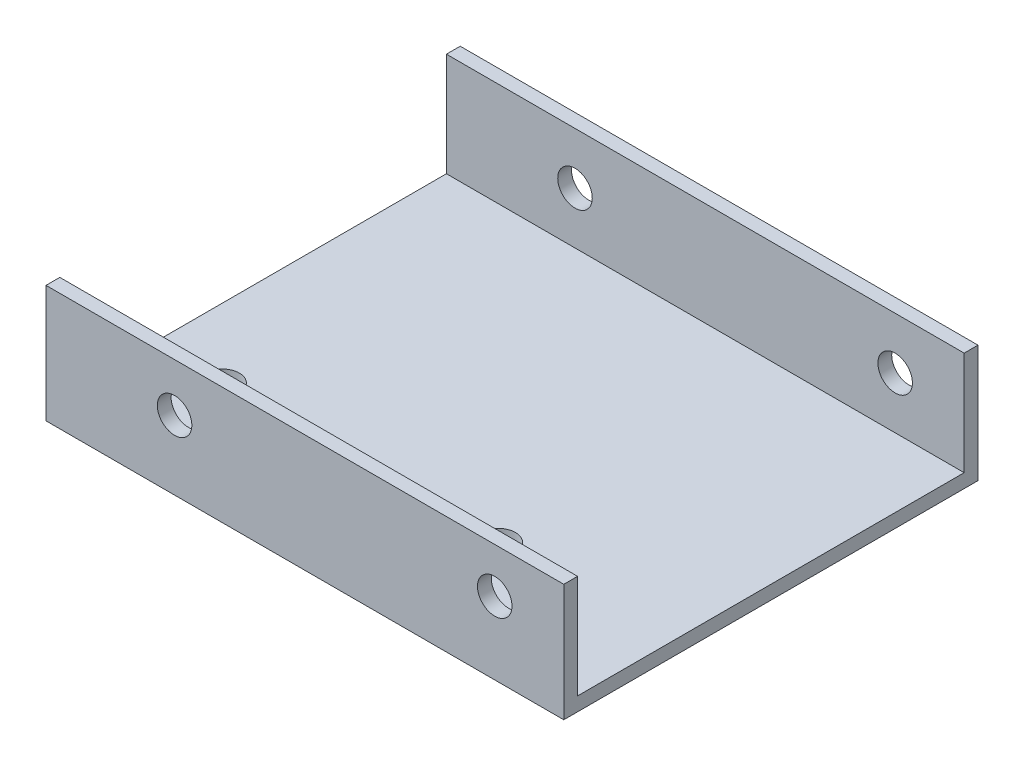
ISO-10303-21;
HEADER;
FILE_DESCRIPTION(('STEP AP214'),'2;1');
FILE_NAME('part.step','',(''),(''),'','','');
FILE_SCHEMA(('AUTOMOTIVE_DESIGN { 1 0 10303 214 1 1 1 1 }'));
ENDSEC;
DATA;
#1=APPLICATION_CONTEXT('core data for automotive mechanical design processes');
#2=APPLICATION_PROTOCOL_DEFINITION('international standard','automotive_design',2000,#1);
#3=PRODUCT_CONTEXT('',#1,'mechanical');
#4=PRODUCT('Part','Part','',(#3));
#5=PRODUCT_RELATED_PRODUCT_CATEGORY('part','',(#4));
#6=PRODUCT_DEFINITION_FORMATION('','',#4);
#7=PRODUCT_DEFINITION_CONTEXT('part definition',#1,'design');
#8=PRODUCT_DEFINITION('design','',#6,#7);
#9=PRODUCT_DEFINITION_SHAPE('','',#8);
#10=(LENGTH_UNIT() NAMED_UNIT(*) SI_UNIT(.MILLI.,.METRE.));
#11=(NAMED_UNIT(*) PLANE_ANGLE_UNIT() SI_UNIT($,.RADIAN.));
#12=(NAMED_UNIT(*) SI_UNIT($,.STERADIAN.) SOLID_ANGLE_UNIT());
#13=UNCERTAINTY_MEASURE_WITH_UNIT(LENGTH_MEASURE(1.E-05),#10,'distance_accuracy_value','');
#14=(GEOMETRIC_REPRESENTATION_CONTEXT(3) GLOBAL_UNCERTAINTY_ASSIGNED_CONTEXT((#13)) GLOBAL_UNIT_ASSIGNED_CONTEXT((#10,
#11,#12)) REPRESENTATION_CONTEXT('',''));
#15=CARTESIAN_POINT('',(0.,0.,0.));
#16=DIRECTION('',(0.,0.,1.));
#17=DIRECTION('',(1.,0.,0.));
#18=AXIS2_PLACEMENT_3D('',#15,#16,#17);
#19=CARTESIAN_POINT('',(-37.5,2.,28.));
#20=DIRECTION('',(1.,0.,0.));
#21=DIRECTION('',(0.,0.,-1.));
#22=AXIS2_PLACEMENT_3D('',#19,#20,#21);
#23=PLANE('',#22);
#24=DIRECTION('',(0.,0.,1.));
#25=VECTOR('',#24,1.);
#26=CARTESIAN_POINT('',(-37.5,0.,28.));
#27=LINE('',#26,#25);
#28=CARTESIAN_POINT('',(-37.5,0.,-30.));
#29=VERTEX_POINT('',#28);
#30=CARTESIAN_POINT('',(-37.5,0.,30.));
#31=VERTEX_POINT('',#30);
#32=EDGE_CURVE('E178',#29,#31,#27,.T.);
#33=ORIENTED_EDGE('',*,*,#32,.T.);
#34=DIRECTION('',(0.,-1.,0.));
#35=VECTOR('',#34,1.);
#36=CARTESIAN_POINT('',(-37.5,0.,30.));
#37=LINE('',#36,#35);
#38=CARTESIAN_POINT('',(-37.5,17.,30.));
#39=VERTEX_POINT('',#38);
#40=EDGE_CURVE('E148',#39,#31,#37,.T.);
#41=ORIENTED_EDGE('',*,*,#40,.F.);
#42=DIRECTION('',(0.,0.,-1.));
#43=VECTOR('',#42,1.);
#44=CARTESIAN_POINT('',(-37.5,17.,30.));
#45=LINE('',#44,#43);
#46=CARTESIAN_POINT('',(-37.5,17.,28.));
#47=VERTEX_POINT('',#46);
#48=EDGE_CURVE('E163',#39,#47,#45,.T.);
#49=ORIENTED_EDGE('',*,*,#48,.T.);
#50=DIRECTION('',(0.,-1.,0.));
#51=VECTOR('',#50,1.);
#52=CARTESIAN_POINT('',(-37.5,0.,28.));
#53=LINE('',#52,#51);
#54=CARTESIAN_POINT('',(-37.5,2.,28.));
#55=VERTEX_POINT('',#54);
#56=EDGE_CURVE('E113',#47,#55,#53,.T.);
#57=ORIENTED_EDGE('',*,*,#56,.T.);
#58=DIRECTION('',(0.,0.,1.));
#59=VECTOR('',#58,1.);
#60=CARTESIAN_POINT('',(-37.5,2.,28.));
#61=LINE('',#60,#59);
#62=CARTESIAN_POINT('',(-37.5,2.,-28.));
#63=VERTEX_POINT('',#62);
#64=EDGE_CURVE('E179',#63,#55,#61,.T.);
#65=ORIENTED_EDGE('',*,*,#64,.F.);
#66=DIRECTION('',(0.,-1.,0.));
#67=VECTOR('',#66,1.);
#68=CARTESIAN_POINT('',(-37.5,0.,-28.));
#69=LINE('',#68,#67);
#70=CARTESIAN_POINT('',(-37.5,17.,-28.));
#71=VERTEX_POINT('',#70);
#72=EDGE_CURVE('E55',#71,#63,#69,.T.);
#73=ORIENTED_EDGE('',*,*,#72,.F.);
#74=DIRECTION('',(0.,0.,1.));
#75=VECTOR('',#74,1.);
#76=CARTESIAN_POINT('',(-37.5,17.,-30.));
#77=LINE('',#76,#75);
#78=CARTESIAN_POINT('',(-37.5,17.,-30.));
#79=VERTEX_POINT('',#78);
#80=EDGE_CURVE('E104',#79,#71,#77,.T.);
#81=ORIENTED_EDGE('',*,*,#80,.F.);
#82=DIRECTION('',(0.,-1.,0.));
#83=VECTOR('',#82,1.);
#84=CARTESIAN_POINT('',(-37.5,0.,-30.));
#85=LINE('',#84,#83);
#86=EDGE_CURVE('E106',#79,#29,#85,.T.);
#87=ORIENTED_EDGE('',*,*,#86,.T.);
#88=EDGE_LOOP('',(#33,#41,#49,#57,#65,#73,#81,#87));
#89=FACE_BOUND('',#88,.T.);
#90=ADVANCED_FACE('F38',(#89),#23,.F.);
#91=CARTESIAN_POINT('',(37.5,2.,28.));
#92=DIRECTION('',(-1.,0.,0.));
#93=DIRECTION('',(0.,0.,1.));
#94=AXIS2_PLACEMENT_3D('',#91,#92,#93);
#95=PLANE('',#94);
#96=DIRECTION('',(0.,0.,-1.));
#97=VECTOR('',#96,1.);
#98=CARTESIAN_POINT('',(37.5,0.,28.));
#99=LINE('',#98,#97);
#100=CARTESIAN_POINT('',(37.5,0.,30.));
#101=VERTEX_POINT('',#100);
#102=CARTESIAN_POINT('',(37.5,0.,-30.));
#103=VERTEX_POINT('',#102);
#104=EDGE_CURVE('E41',#101,#103,#99,.T.);
#105=ORIENTED_EDGE('',*,*,#104,.T.);
#106=DIRECTION('',(0.,1.,0.));
#107=VECTOR('',#106,1.);
#108=CARTESIAN_POINT('',(37.5,0.,-30.));
#109=LINE('',#108,#107);
#110=CARTESIAN_POINT('',(37.5,17.,-30.));
#111=VERTEX_POINT('',#110);
#112=EDGE_CURVE('E130',#103,#111,#109,.T.);
#113=ORIENTED_EDGE('',*,*,#112,.T.);
#114=DIRECTION('',(0.,0.,1.));
#115=VECTOR('',#114,1.);
#116=CARTESIAN_POINT('',(37.5,17.,-30.));
#117=LINE('',#116,#115);
#118=CARTESIAN_POINT('',(37.5,17.,-28.));
#119=VERTEX_POINT('',#118);
#120=EDGE_CURVE('E114',#111,#119,#117,.T.);
#121=ORIENTED_EDGE('',*,*,#120,.T.);
#122=DIRECTION('',(0.,1.,0.));
#123=VECTOR('',#122,1.);
#124=CARTESIAN_POINT('',(37.5,0.,-28.));
#125=LINE('',#124,#123);
#126=CARTESIAN_POINT('',(37.5,2.,-28.));
#127=VERTEX_POINT('',#126);
#128=EDGE_CURVE('E125',#127,#119,#125,.T.);
#129=ORIENTED_EDGE('',*,*,#128,.F.);
#130=DIRECTION('',(0.,0.,-1.));
#131=VECTOR('',#130,1.);
#132=CARTESIAN_POINT('',(37.5,2.,28.));
#133=LINE('',#132,#131);
#134=CARTESIAN_POINT('',(37.5,2.,28.));
#135=VERTEX_POINT('',#134);
#136=EDGE_CURVE('E47',#135,#127,#133,.T.);
#137=ORIENTED_EDGE('',*,*,#136,.F.);
#138=DIRECTION('',(0.,1.,0.));
#139=VECTOR('',#138,1.);
#140=CARTESIAN_POINT('',(37.5,0.,28.));
#141=LINE('',#140,#139);
#142=CARTESIAN_POINT('',(37.5,17.,28.));
#143=VERTEX_POINT('',#142);
#144=EDGE_CURVE('E62',#135,#143,#141,.T.);
#145=ORIENTED_EDGE('',*,*,#144,.T.);
#146=DIRECTION('',(0.,0.,-1.));
#147=VECTOR('',#146,1.);
#148=CARTESIAN_POINT('',(37.5,17.,30.));
#149=LINE('',#148,#147);
#150=CARTESIAN_POINT('',(37.5,17.,30.));
#151=VERTEX_POINT('',#150);
#152=EDGE_CURVE('E174',#151,#143,#149,.T.);
#153=ORIENTED_EDGE('',*,*,#152,.F.);
#154=DIRECTION('',(0.,1.,0.));
#155=VECTOR('',#154,1.);
#156=CARTESIAN_POINT('',(37.5,0.,30.));
#157=LINE('',#156,#155);
#158=EDGE_CURVE('E157',#101,#151,#157,.T.);
#159=ORIENTED_EDGE('',*,*,#158,.F.);
#160=EDGE_LOOP('',(#105,#113,#121,#129,#137,#145,#153,#159));
#161=FACE_BOUND('',#160,.T.);
#162=ADVANCED_FACE('F194',(#161),#95,.F.);
#163=CARTESIAN_POINT('',(0.,2.,0.));
#164=DIRECTION('',(0.,1.,0.));
#165=DIRECTION('',(0.,0.,1.));
#166=AXIS2_PLACEMENT_3D('',#163,#164,#165);
#167=PLANE('',#166);
#168=CARTESIAN_POINT('',(12.5,2.,14.4999999999972));
#169=DIRECTION('',(0.,-1.,0.));
#170=DIRECTION('',(0.,0.,-1.));
#171=AXIS2_PLACEMENT_3D('',#168,#169,#170);
#172=CIRCLE('',#171,2.5000000000005);
#173=CARTESIAN_POINT('',(12.5,2.,11.9999999999967));
#174=VERTEX_POINT('',#173);
#175=EDGE_CURVE('E266',#174,#174,#172,.T.);
#176=ORIENTED_EDGE('',*,*,#175,.T.);
#177=EDGE_LOOP('',(#176));
#178=FACE_BOUND('',#177,.T.);
#179=CARTESIAN_POINT('',(-27.4999999999997,2.,14.4999999999973));
#180=DIRECTION('',(0.,-1.,0.));
#181=DIRECTION('',(0.,0.,-1.));
#182=AXIS2_PLACEMENT_3D('',#179,#180,#181);
#183=CIRCLE('',#182,2.50000000000049);
#184=CARTESIAN_POINT('',(-27.4999999999997,2.,11.9999999999968));
#185=VERTEX_POINT('',#184);
#186=EDGE_CURVE('E271',#185,#185,#183,.T.);
#187=ORIENTED_EDGE('',*,*,#186,.T.);
#188=EDGE_LOOP('',(#187));
#189=FACE_BOUND('',#188,.T.);
#190=ORIENTED_EDGE('',*,*,#64,.T.);
#191=DIRECTION('',(1.,0.,0.));
#192=VECTOR('',#191,1.);
#193=CARTESIAN_POINT('',(37.5,2.,28.));
#194=LINE('',#193,#192);
#195=EDGE_CURVE('E183',#55,#135,#194,.T.);
#196=ORIENTED_EDGE('',*,*,#195,.T.);
#197=ORIENTED_EDGE('',*,*,#136,.T.);
#198=DIRECTION('',(-1.,0.,0.));
#199=VECTOR('',#198,1.);
#200=CARTESIAN_POINT('',(37.5,2.,-28.));
#201=LINE('',#200,#199);
#202=EDGE_CURVE('E11',#127,#63,#201,.T.);
#203=ORIENTED_EDGE('',*,*,#202,.T.);
#204=EDGE_LOOP('',(#190,#196,#197,#203));
#205=FACE_BOUND('',#204,.T.);
#206=ADVANCED_FACE('F207',(#178,#189,#205),#167,.T.);
#207=CARTESIAN_POINT('',(0.,0.,0.));
#208=DIRECTION('',(0.,1.,0.));
#209=DIRECTION('',(0.,0.,1.));
#210=AXIS2_PLACEMENT_3D('',#207,#208,#209);
#211=PLANE('',#210);
#212=CARTESIAN_POINT('',(12.5,0.,14.4999999999972));
#213=DIRECTION('',(0.,-1.,0.));
#214=DIRECTION('',(0.,0.,-1.));
#215=AXIS2_PLACEMENT_3D('',#212,#213,#214);
#216=CIRCLE('',#215,2.5000000000005);
#217=CARTESIAN_POINT('',(12.5,0.,11.9999999999967));
#218=VERTEX_POINT('',#217);
#219=EDGE_CURVE('E276',#218,#218,#216,.T.);
#220=ORIENTED_EDGE('',*,*,#219,.F.);
#221=EDGE_LOOP('',(#220));
#222=FACE_BOUND('',#221,.T.);
#223=CARTESIAN_POINT('',(-27.4999999999997,0.,14.4999999999973));
#224=DIRECTION('',(0.,-1.,0.));
#225=DIRECTION('',(0.,0.,-1.));
#226=AXIS2_PLACEMENT_3D('',#223,#224,#225);
#227=CIRCLE('',#226,2.50000000000049);
#228=CARTESIAN_POINT('',(-27.4999999999997,0.,11.9999999999968));
#229=VERTEX_POINT('',#228);
#230=EDGE_CURVE('E267',#229,#229,#227,.T.);
#231=ORIENTED_EDGE('',*,*,#230,.F.);
#232=EDGE_LOOP('',(#231));
#233=FACE_BOUND('',#232,.T.);
#234=ORIENTED_EDGE('',*,*,#32,.F.);
#235=DIRECTION('',(1.,0.,0.));
#236=VECTOR('',#235,1.);
#237=CARTESIAN_POINT('',(-37.5,0.,-30.));
#238=LINE('',#237,#236);
#239=EDGE_CURVE('E123',#29,#103,#238,.T.);
#240=ORIENTED_EDGE('',*,*,#239,.T.);
#241=ORIENTED_EDGE('',*,*,#104,.F.);
#242=DIRECTION('',(1.,0.,0.));
#243=VECTOR('',#242,1.);
#244=CARTESIAN_POINT('',(-37.5,0.,30.));
#245=LINE('',#244,#243);
#246=EDGE_CURVE('E152',#31,#101,#245,.T.);
#247=ORIENTED_EDGE('',*,*,#246,.F.);
#248=EDGE_LOOP('',(#234,#240,#241,#247));
#249=FACE_BOUND('',#248,.T.);
#250=ADVANCED_FACE('F197',(#222,#233,#249),#211,.F.);
#251=CARTESIAN_POINT('',(0.,0.,28.));
#252=DIRECTION('',(0.,0.,-1.));
#253=DIRECTION('',(-1.,0.,0.));
#254=AXIS2_PLACEMENT_3D('',#251,#252,#253);
#255=PLANE('',#254);
#256=CARTESIAN_POINT('',(27.5,10.5,28.));
#257=DIRECTION('',(0.,0.,-1.));
#258=DIRECTION('',(-1.,0.,0.));
#259=AXIS2_PLACEMENT_3D('',#256,#257,#258);
#260=CIRCLE('',#259,2.5);
#261=CARTESIAN_POINT('',(25.,10.5,28.));
#262=VERTEX_POINT('',#261);
#263=EDGE_CURVE('E250',#262,#262,#260,.F.);
#264=ORIENTED_EDGE('',*,*,#263,.T.);
#265=EDGE_LOOP('',(#264));
#266=FACE_BOUND('',#265,.T.);
#267=CARTESIAN_POINT('',(-18.875,10.,28.));
#268=DIRECTION('',(0.,0.,-1.));
#269=DIRECTION('',(-1.,0.,0.));
#270=AXIS2_PLACEMENT_3D('',#267,#268,#269);
#271=CIRCLE('',#270,2.49999999999999);
#272=CARTESIAN_POINT('',(-21.375,10.,28.));
#273=VERTEX_POINT('',#272);
#274=EDGE_CURVE('E253',#273,#273,#271,.F.);
#275=ORIENTED_EDGE('',*,*,#274,.T.);
#276=EDGE_LOOP('',(#275));
#277=FACE_BOUND('',#276,.T.);
#278=ORIENTED_EDGE('',*,*,#195,.F.);
#279=ORIENTED_EDGE('',*,*,#56,.F.);
#280=DIRECTION('',(-1.,0.,0.));
#281=VECTOR('',#280,1.);
#282=CARTESIAN_POINT('',(-37.5,17.,28.));
#283=LINE('',#282,#281);
#284=EDGE_CURVE('E153',#143,#47,#283,.T.);
#285=ORIENTED_EDGE('',*,*,#284,.F.);
#286=ORIENTED_EDGE('',*,*,#144,.F.);
#287=EDGE_LOOP('',(#278,#279,#285,#286));
#288=FACE_BOUND('',#287,.T.);
#289=ADVANCED_FACE('F204',(#266,#277,#288),#255,.T.);
#290=CARTESIAN_POINT('',(-37.5,17.,30.));
#291=DIRECTION('',(0.,-1.,0.));
#292=DIRECTION('',(0.,0.,-1.));
#293=AXIS2_PLACEMENT_3D('',#290,#291,#292);
#294=PLANE('',#293);
#295=ORIENTED_EDGE('',*,*,#284,.T.);
#296=ORIENTED_EDGE('',*,*,#48,.F.);
#297=DIRECTION('',(-1.,0.,0.));
#298=VECTOR('',#297,1.);
#299=CARTESIAN_POINT('',(-37.5,17.,30.));
#300=LINE('',#299,#298);
#301=EDGE_CURVE('E160',#151,#39,#300,.T.);
#302=ORIENTED_EDGE('',*,*,#301,.F.);
#303=ORIENTED_EDGE('',*,*,#152,.T.);
#304=EDGE_LOOP('',(#295,#296,#302,#303));
#305=FACE_BOUND('',#304,.T.);
#306=ADVANCED_FACE('F220',(#305),#294,.F.);
#307=CARTESIAN_POINT('',(0.,0.,30.));
#308=DIRECTION('',(0.,0.,-1.));
#309=DIRECTION('',(-1.,0.,0.));
#310=AXIS2_PLACEMENT_3D('',#307,#308,#309);
#311=PLANE('',#310);
#312=CARTESIAN_POINT('',(27.5,10.5,30.));
#313=DIRECTION('',(0.,0.,1.));
#314=DIRECTION('',(1.,0.,0.));
#315=AXIS2_PLACEMENT_3D('',#312,#313,#314);
#316=CIRCLE('',#315,2.5);
#317=CARTESIAN_POINT('',(30.,10.5,30.));
#318=VERTEX_POINT('',#317);
#319=EDGE_CURVE('E256',#318,#318,#316,.T.);
#320=ORIENTED_EDGE('',*,*,#319,.F.);
#321=EDGE_LOOP('',(#320));
#322=FACE_BOUND('',#321,.T.);
#323=CARTESIAN_POINT('',(-18.875,10.,30.));
#324=DIRECTION('',(0.,0.,-1.));
#325=DIRECTION('',(-1.,0.,0.));
#326=AXIS2_PLACEMENT_3D('',#323,#324,#325);
#327=CIRCLE('',#326,2.49999999999999);
#328=CARTESIAN_POINT('',(-21.375,10.,30.));
#329=VERTEX_POINT('',#328);
#330=EDGE_CURVE('E141',#329,#329,#327,.F.);
#331=ORIENTED_EDGE('',*,*,#330,.F.);
#332=EDGE_LOOP('',(#331));
#333=FACE_BOUND('',#332,.T.);
#334=ORIENTED_EDGE('',*,*,#40,.T.);
#335=ORIENTED_EDGE('',*,*,#246,.T.);
#336=ORIENTED_EDGE('',*,*,#158,.T.);
#337=ORIENTED_EDGE('',*,*,#301,.T.);
#338=EDGE_LOOP('',(#334,#335,#336,#337));
#339=FACE_BOUND('',#338,.T.);
#340=ADVANCED_FACE('F199',(#322,#333,#339),#311,.F.);
#341=CARTESIAN_POINT('',(0.,0.,-28.));
#342=DIRECTION('',(0.,0.,1.));
#343=DIRECTION('',(-1.,0.,0.));
#344=AXIS2_PLACEMENT_3D('',#341,#342,#343);
#345=PLANE('',#344);
#346=CARTESIAN_POINT('',(-18.875,9.5,-28.));
#347=DIRECTION('',(0.,0.,1.));
#348=DIRECTION('',(1.,0.,0.));
#349=AXIS2_PLACEMENT_3D('',#346,#347,#348);
#350=CIRCLE('',#349,2.5);
#351=CARTESIAN_POINT('',(-16.375,9.5,-28.));
#352=VERTEX_POINT('',#351);
#353=EDGE_CURVE('E294',#352,#352,#350,.F.);
#354=ORIENTED_EDGE('',*,*,#353,.T.);
#355=EDGE_LOOP('',(#354));
#356=FACE_BOUND('',#355,.T.);
#357=CARTESIAN_POINT('',(27.5,9.5,-28.));
#358=DIRECTION('',(0.,0.,1.));
#359=DIRECTION('',(1.,0.,0.));
#360=AXIS2_PLACEMENT_3D('',#357,#358,#359);
#361=CIRCLE('',#360,2.5);
#362=CARTESIAN_POINT('',(30.,9.5,-28.));
#363=VERTEX_POINT('',#362);
#364=EDGE_CURVE('E286',#363,#363,#361,.F.);
#365=ORIENTED_EDGE('',*,*,#364,.T.);
#366=EDGE_LOOP('',(#365));
#367=FACE_BOUND('',#366,.T.);
#368=ORIENTED_EDGE('',*,*,#202,.F.);
#369=ORIENTED_EDGE('',*,*,#128,.T.);
#370=DIRECTION('',(-1.,0.,0.));
#371=VECTOR('',#370,1.);
#372=CARTESIAN_POINT('',(-37.5,17.,-28.));
#373=LINE('',#372,#371);
#374=EDGE_CURVE('E140',#119,#71,#373,.T.);
#375=ORIENTED_EDGE('',*,*,#374,.T.);
#376=ORIENTED_EDGE('',*,*,#72,.T.);
#377=EDGE_LOOP('',(#368,#369,#375,#376));
#378=FACE_BOUND('',#377,.T.);
#379=ADVANCED_FACE('F209',(#356,#367,#378),#345,.T.);
#380=CARTESIAN_POINT('',(-37.5,17.,-30.));
#381=DIRECTION('',(0.,1.,0.));
#382=DIRECTION('',(0.,0.,1.));
#383=AXIS2_PLACEMENT_3D('',#380,#381,#382);
#384=PLANE('',#383);
#385=ORIENTED_EDGE('',*,*,#374,.F.);
#386=ORIENTED_EDGE('',*,*,#120,.F.);
#387=DIRECTION('',(-1.,0.,0.));
#388=VECTOR('',#387,1.);
#389=CARTESIAN_POINT('',(-37.5,17.,-30.));
#390=LINE('',#389,#388);
#391=EDGE_CURVE('E120',#111,#79,#390,.T.);
#392=ORIENTED_EDGE('',*,*,#391,.T.);
#393=ORIENTED_EDGE('',*,*,#80,.T.);
#394=EDGE_LOOP('',(#385,#386,#392,#393));
#395=FACE_BOUND('',#394,.T.);
#396=ADVANCED_FACE('F127',(#395),#384,.T.);
#397=CARTESIAN_POINT('',(0.,0.,-30.));
#398=DIRECTION('',(0.,0.,1.));
#399=DIRECTION('',(-1.,0.,0.));
#400=AXIS2_PLACEMENT_3D('',#397,#398,#399);
#401=PLANE('',#400);
#402=CARTESIAN_POINT('',(-18.875,9.5,-30.));
#403=DIRECTION('',(0.,0.,-1.));
#404=DIRECTION('',(-1.,0.,0.));
#405=AXIS2_PLACEMENT_3D('',#402,#403,#404);
#406=CIRCLE('',#405,2.5);
#407=CARTESIAN_POINT('',(-21.375,9.5,-30.));
#408=VERTEX_POINT('',#407);
#409=EDGE_CURVE('E290',#408,#408,#406,.T.);
#410=ORIENTED_EDGE('',*,*,#409,.F.);
#411=EDGE_LOOP('',(#410));
#412=FACE_BOUND('',#411,.T.);
#413=CARTESIAN_POINT('',(27.5,9.5,-30.));
#414=DIRECTION('',(0.,0.,-1.));
#415=DIRECTION('',(-1.,0.,0.));
#416=AXIS2_PLACEMENT_3D('',#413,#414,#415);
#417=CIRCLE('',#416,2.5);
#418=CARTESIAN_POINT('',(25.,9.5,-30.));
#419=VERTEX_POINT('',#418);
#420=EDGE_CURVE('E272',#419,#419,#417,.T.);
#421=ORIENTED_EDGE('',*,*,#420,.F.);
#422=EDGE_LOOP('',(#421));
#423=FACE_BOUND('',#422,.T.);
#424=ORIENTED_EDGE('',*,*,#86,.F.);
#425=ORIENTED_EDGE('',*,*,#391,.F.);
#426=ORIENTED_EDGE('',*,*,#112,.F.);
#427=ORIENTED_EDGE('',*,*,#239,.F.);
#428=EDGE_LOOP('',(#424,#425,#426,#427));
#429=FACE_BOUND('',#428,.T.);
#430=ADVANCED_FACE('F118',(#412,#423,#429),#401,.F.);
#431=CARTESIAN_POINT('',(-18.875,10.,-30.001));
#432=DIRECTION('',(0.,0.,1.));
#433=DIRECTION('',(1.,0.,0.));
#434=AXIS2_PLACEMENT_3D('',#431,#432,#433);
#435=CYLINDRICAL_SURFACE('',#434,2.49999999999999);
#436=ORIENTED_EDGE('',*,*,#274,.F.);
#437=EDGE_LOOP('',(#436));
#438=FACE_BOUND('',#437,.T.);
#439=ORIENTED_EDGE('',*,*,#330,.T.);
#440=EDGE_LOOP('',(#439));
#441=FACE_BOUND('',#440,.T.);
#442=ADVANCED_FACE('F306',(#438,#441),#435,.F.);
#443=CARTESIAN_POINT('',(27.5,10.5,-30.001));
#444=DIRECTION('',(0.,0.,1.));
#445=DIRECTION('',(1.,0.,0.));
#446=AXIS2_PLACEMENT_3D('',#443,#444,#445);
#447=CYLINDRICAL_SURFACE('',#446,2.5);
#448=ORIENTED_EDGE('',*,*,#263,.F.);
#449=EDGE_LOOP('',(#448));
#450=FACE_BOUND('',#449,.T.);
#451=ORIENTED_EDGE('',*,*,#319,.T.);
#452=EDGE_LOOP('',(#451));
#453=FACE_BOUND('',#452,.T.);
#454=ADVANCED_FACE('F322',(#450,#453),#447,.F.);
#455=CARTESIAN_POINT('',(-27.4999999999997,2.,14.4999999999973));
#456=DIRECTION('',(0.,-1.,0.));
#457=DIRECTION('',(0.,0.,-1.));
#458=AXIS2_PLACEMENT_3D('',#455,#456,#457);
#459=CYLINDRICAL_SURFACE('',#458,2.50000000000049);
#460=ORIENTED_EDGE('',*,*,#186,.F.);
#461=EDGE_LOOP('',(#460));
#462=FACE_BOUND('',#461,.T.);
#463=ORIENTED_EDGE('',*,*,#230,.T.);
#464=EDGE_LOOP('',(#463));
#465=FACE_BOUND('',#464,.T.);
#466=ADVANCED_FACE('F315',(#462,#465),#459,.F.);
#467=CARTESIAN_POINT('',(12.5,2.,14.4999999999972));
#468=DIRECTION('',(0.,-1.,0.));
#469=DIRECTION('',(0.,0.,-1.));
#470=AXIS2_PLACEMENT_3D('',#467,#468,#469);
#471=CYLINDRICAL_SURFACE('',#470,2.5000000000005);
#472=ORIENTED_EDGE('',*,*,#175,.F.);
#473=EDGE_LOOP('',(#472));
#474=FACE_BOUND('',#473,.T.);
#475=ORIENTED_EDGE('',*,*,#219,.T.);
#476=EDGE_LOOP('',(#475));
#477=FACE_BOUND('',#476,.T.);
#478=ADVANCED_FACE('F310',(#474,#477),#471,.F.);
#479=CARTESIAN_POINT('',(27.5,9.5,30.001));
#480=DIRECTION('',(0.,0.,-1.));
#481=DIRECTION('',(-1.,0.,0.));
#482=AXIS2_PLACEMENT_3D('',#479,#480,#481);
#483=CYLINDRICAL_SURFACE('',#482,2.5);
#484=ORIENTED_EDGE('',*,*,#364,.F.);
#485=EDGE_LOOP('',(#484));
#486=FACE_BOUND('',#485,.T.);
#487=ORIENTED_EDGE('',*,*,#420,.T.);
#488=EDGE_LOOP('',(#487));
#489=FACE_BOUND('',#488,.T.);
#490=ADVANCED_FACE('F301',(#486,#489),#483,.F.);
#491=CARTESIAN_POINT('',(-18.875,9.5,30.001));
#492=DIRECTION('',(0.,0.,-1.));
#493=DIRECTION('',(-1.,0.,0.));
#494=AXIS2_PLACEMENT_3D('',#491,#492,#493);
#495=CYLINDRICAL_SURFACE('',#494,2.5);
#496=ORIENTED_EDGE('',*,*,#353,.F.);
#497=EDGE_LOOP('',(#496));
#498=FACE_BOUND('',#497,.T.);
#499=ORIENTED_EDGE('',*,*,#409,.T.);
#500=EDGE_LOOP('',(#499));
#501=FACE_BOUND('',#500,.T.);
#502=ADVANCED_FACE('F298',(#498,#501),#495,.F.);
#503=CLOSED_SHELL('',(#90,#162,#206,#250,#289,#306,#340,#379,#396,#430,#442,#454,#466,#478,#490,#502));
#504=MANIFOLD_SOLID_BREP('B2',#503);
#505=ADVANCED_BREP_SHAPE_REPRESENTATION('',(#18,#504),#14);
#506=SHAPE_DEFINITION_REPRESENTATION(#9,#505);
ENDSEC;
END-ISO-10303-21;
